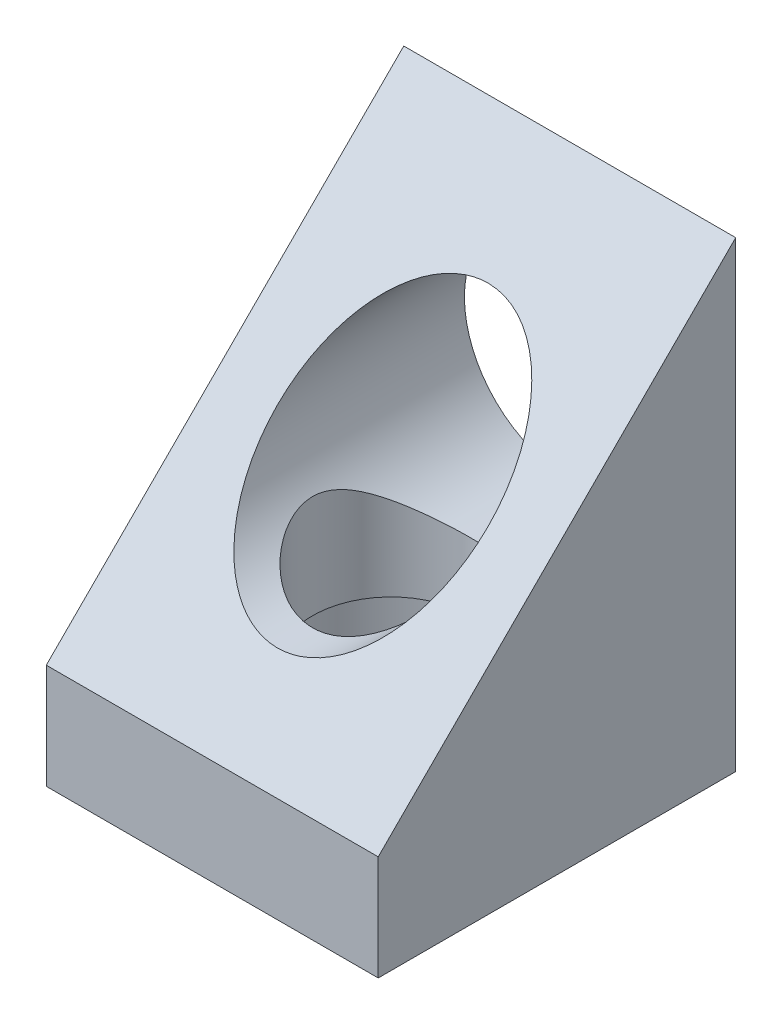
ISO-10303-21;
HEADER;
FILE_DESCRIPTION(('STEP AP214'),'2;1');
FILE_NAME('part.step','',(''),(''),'','','');
FILE_SCHEMA(('AUTOMOTIVE_DESIGN { 1 0 10303 214 1 1 1 1 }'));
ENDSEC;
DATA;
#1=APPLICATION_CONTEXT('core data for automotive mechanical design processes');
#2=APPLICATION_PROTOCOL_DEFINITION('international standard','automotive_design',2000,#1);
#3=PRODUCT_CONTEXT('',#1,'mechanical');
#4=PRODUCT('Part','Part','',(#3));
#5=PRODUCT_RELATED_PRODUCT_CATEGORY('part','',(#4));
#6=PRODUCT_DEFINITION_FORMATION('','',#4);
#7=PRODUCT_DEFINITION_CONTEXT('part definition',#1,'design');
#8=PRODUCT_DEFINITION('design','',#6,#7);
#9=PRODUCT_DEFINITION_SHAPE('','',#8);
#10=(LENGTH_UNIT() NAMED_UNIT(*) SI_UNIT(.MILLI.,.METRE.));
#11=(NAMED_UNIT(*) PLANE_ANGLE_UNIT() SI_UNIT($,.RADIAN.));
#12=(NAMED_UNIT(*) SI_UNIT($,.STERADIAN.) SOLID_ANGLE_UNIT());
#13=UNCERTAINTY_MEASURE_WITH_UNIT(LENGTH_MEASURE(1.E-05),#10,'distance_accuracy_value','');
#14=(GEOMETRIC_REPRESENTATION_CONTEXT(3) GLOBAL_UNCERTAINTY_ASSIGNED_CONTEXT((#13)) GLOBAL_UNIT_ASSIGNED_CONTEXT((#10,
#11,#12)) REPRESENTATION_CONTEXT('',''));
#15=CARTESIAN_POINT('',(0.,0.,0.));
#16=DIRECTION('',(0.,0.,1.));
#17=DIRECTION('',(1.,0.,0.));
#18=AXIS2_PLACEMENT_3D('',#15,#16,#17);
#19=CARTESIAN_POINT('',(13.,36.2199999999999,-14.));
#20=DIRECTION('',(0.,-1.,0.));
#21=DIRECTION('',(0.,0.,-1.));
#22=AXIS2_PLACEMENT_3D('',#19,#20,#21);
#23=CYLINDRICAL_SURFACE('',#22,6.15);
#24=CARTESIAN_POINT('',(13.,13.33,-20.15));
#25=CARTESIAN_POINT('',(13.1503835526445,13.3300014199679,-20.1499985251012));
#26=CARTESIAN_POINT('',(13.3008161414363,13.3341222645287,-20.144473554206));
#27=CARTESIAN_POINT('',(13.6004980932007,13.3505133182725,-20.1224589342896));
#28=CARTESIAN_POINT('',(13.7497466155259,13.3627888699825,-20.1059620970814));
#29=CARTESIAN_POINT('',(14.0461132267396,13.3952329697566,-20.0622295326929));
#30=CARTESIAN_POINT('',(14.1932262120438,13.4154179578461,-20.0349714369881));
#31=CARTESIAN_POINT('',(14.4839817652055,13.4632259113498,-19.970134037649));
#32=CARTESIAN_POINT('',(14.6276227446917,13.4908522133675,-19.9325501038708));
#33=CARTESIAN_POINT('',(14.9095201747263,13.5527393482053,-19.847883715537));
#34=CARTESIAN_POINT('',(15.0478059963155,13.586955008632,-19.8008658469617));
#35=CARTESIAN_POINT('',(15.319289232892,13.6614618116622,-19.6977636052433));
#36=CARTESIAN_POINT('',(15.452484609643,13.7017553565852,-19.641675646459));
#37=CARTESIAN_POINT('',(15.843287727748,13.8305960889122,-19.460812310771));
#38=CARTESIAN_POINT('',(16.0924968201286,13.9271908334478,-19.3233198553164));
#39=CARTESIAN_POINT('',(16.5868880595482,14.1451845680513,-19.0051130282842));
#40=CARTESIAN_POINT('',(16.82957467279,14.2680501775405,-18.8215803401999));
#41=CARTESIAN_POINT('',(17.2829158004911,14.5240168404874,-18.4238238469546));
#42=CARTESIAN_POINT('',(17.4935189977293,14.6571337894449,-18.2095519155904));
#43=CARTESIAN_POINT('',(17.8035772714523,14.8711845699739,-17.8445333561419));
#44=CARTESIAN_POINT('',(17.9138410115293,14.9517364840365,-17.7025735728797));
#45=CARTESIAN_POINT('',(18.1219724628634,15.111223854249,-17.4088572193787));
#46=CARTESIAN_POINT('',(18.2198364755572,15.1901588222417,-17.2570977463918));
#47=CARTESIAN_POINT('',(18.4025304161034,15.3438631312988,-16.9441377501915));
#48=CARTESIAN_POINT('',(18.4873738814289,15.4186367466421,-16.7829472766463));
#49=CARTESIAN_POINT('',(18.6433565718706,15.5611810056015,-16.4512517588928));
#50=CARTESIAN_POINT('',(18.7145035719045,15.628955612076,-16.2807520701247));
#51=CARTESIAN_POINT('',(18.8624032070704,15.7740871132528,-15.8748048903036));
#52=CARTESIAN_POINT('',(18.9337747240707,15.84766371032,-15.6359117024777));
#53=CARTESIAN_POINT('',(19.0191884046415,15.9378741132208,-15.2679653546693));
#54=CARTESIAN_POINT('',(19.0440445846388,15.9645759516353,-15.1437868612718));
#55=CARTESIAN_POINT('',(19.0861822905643,16.0102733578994,-14.8927778887567));
#56=CARTESIAN_POINT('',(19.1034676915191,16.0292728677365,-14.7659488012305));
#57=CARTESIAN_POINT('',(19.1302452216894,16.0588587949102,-14.5093040064635));
#58=CARTESIAN_POINT('',(19.1396649864281,16.0693670643076,-14.3794716225041));
#59=CARTESIAN_POINT('',(19.1502283089094,16.0811587061334,-14.1190489782193));
#60=CARTESIAN_POINT('',(19.1513720666929,16.082442301533,-13.9884587362887));
#61=CARTESIAN_POINT('',(19.1453515649405,16.0757129473225,-13.7276611377051));
#62=CARTESIAN_POINT('',(19.1381842327849,16.0676965594973,-13.5974539405108));
#63=CARTESIAN_POINT('',(19.1157168989009,16.0427827689124,-13.3386348528672));
#64=CARTESIAN_POINT('',(19.1004168019612,16.0258852621803,-13.2100229811126));
#65=CARTESIAN_POINT('',(19.0467443354251,15.9673319698838,-12.8543078776177));
#66=CARTESIAN_POINT('',(18.9996965676281,15.916667929872,-12.6299307702371));
#67=CARTESIAN_POINT('',(18.8828746150533,15.7954282493518,-12.1928845564181));
#68=CARTESIAN_POINT('',(18.8130791158108,15.7248339426545,-11.9802266501189));
#69=CARTESIAN_POINT('',(18.6683154596379,15.5849331328068,-11.6073639586438));
#70=CARTESIAN_POINT('',(18.596865978583,15.5179435013044,-11.444884611894));
#71=CARTESIAN_POINT('',(18.4414054344089,15.3780211018212,-11.1286465337572));
#72=CARTESIAN_POINT('',(18.3573880519886,15.3050853524991,-10.9748922433947));
#73=CARTESIAN_POINT('',(18.1772566451757,15.1556524175246,-10.6759927602815));
#74=CARTESIAN_POINT('',(18.0811181017668,15.0791482169044,-10.5308659205072));
#75=CARTESIAN_POINT('',(17.8773018815927,14.9248694389583,-10.2497247243449));
#76=CARTESIAN_POINT('',(17.769625983052,14.8470950589636,-10.1137089689243));
#77=CARTESIAN_POINT('',(17.5403090348244,14.6903089830559,-9.84793754530147));
#78=CARTESIAN_POINT('',(17.4183976075493,14.6113116157989,-9.7184064735335));
#79=CARTESIAN_POINT('',(17.1629728921322,14.4557795166642,-9.46966522747358));
#80=CARTESIAN_POINT('',(17.0294584348509,14.3792450340177,-9.35045609565793));
#81=CARTESIAN_POINT('',(16.7513392766245,14.2305251726609,-9.12330713036188));
#82=CARTESIAN_POINT('',(16.6067539540189,14.1583325724192,-9.01534835274987));
#83=CARTESIAN_POINT('',(16.3066955897243,14.0198712931162,-8.81144097332652));
#84=CARTESIAN_POINT('',(16.1512254156453,13.9536010642036,-8.71548922669628));
#85=CARTESIAN_POINT('',(15.8627745850373,13.8414051574285,-8.55496247225651));
#86=CARTESIAN_POINT('',(15.7316715681266,13.7940863503428,-8.48797887560631));
#87=CARTESIAN_POINT('',(15.4634196042388,13.7051018024051,-8.36298404873124));
#88=CARTESIAN_POINT('',(15.3262719098137,13.6634348976193,-8.30497097080254));
#89=CARTESIAN_POINT('',(15.0465475262124,13.5865540971867,-8.19857522019021));
#90=CARTESIAN_POINT('',(14.9039715858824,13.5513393153139,-8.15019122483334));
#91=CARTESIAN_POINT('',(14.6142426333555,13.4881095552341,-8.06370811731971));
#92=CARTESIAN_POINT('',(14.4670919023396,13.4600910512237,-8.02560396810812));
#93=CARTESIAN_POINT('',(14.1681992195679,13.4117156311941,-7.96001957791852));
#94=CARTESIAN_POINT('',(14.0164342369735,13.3914079389307,-7.9326075633627));
#95=CARTESIAN_POINT('',(13.7103883775554,13.3592019548532,-7.88921179838236));
#96=CARTESIAN_POINT('',(13.5561074954553,13.3473036806775,-7.87322807192802));
#97=CARTESIAN_POINT('',(13.2463980660886,13.3322234851936,-7.85297932629021));
#98=CARTESIAN_POINT('',(13.0909698755402,13.3290389603503,-7.84871080678082));
#99=CARTESIAN_POINT('',(12.7803130546598,13.3314631104223,-7.85196271098836));
#100=CARTESIAN_POINT('',(12.6250844104495,13.3370711365554,-7.85948226489043));
#101=CARTESIAN_POINT('',(12.3312525445608,13.3559621596412,-7.8848662369877));
#102=CARTESIAN_POINT('',(12.1925023941041,13.368444560283,-7.90165192834416));
#103=CARTESIAN_POINT('',(11.917180078369,13.4001949211975,-7.94447216115094));
#104=CARTESIAN_POINT('',(11.7806086549909,13.4194651433947,-7.97050978567375));
#105=CARTESIAN_POINT('',(11.5105765843834,13.4644074732554,-8.03147693721437));
#106=CARTESIAN_POINT('',(11.3771152161514,13.490078080646,-8.06640438046706));
#107=CARTESIAN_POINT('',(11.1139805602036,13.5473417543742,-8.14471988133054));
#108=CARTESIAN_POINT('',(10.9843087591956,13.5789371099696,-8.18811120955497));
#109=CARTESIAN_POINT('',(10.5920697568549,13.6844724694586,-8.33395843359274));
#110=CARTESIAN_POINT('',(10.3366992480016,13.7673842215363,-8.44971598515288));
#111=CARTESIAN_POINT('',(9.84910994669114,13.9509453589326,-8.71122569130956));
#112=CARTESIAN_POINT('',(9.61689429239517,14.0515971434431,-8.85698190342339));
#113=CARTESIAN_POINT('',(9.14040788222493,14.282918349312,-9.20141834279315));
#114=CARTESIAN_POINT('',(8.90066738642173,14.4157898533773,-9.40487606875184));
#115=CARTESIAN_POINT('',(8.45624701433959,14.6890661957817,-9.8437199101059));
#116=CARTESIAN_POINT('',(8.2516502953788,14.8294878968873,-10.0791794549961));
#117=CARTESIAN_POINT('',(7.95537091235652,15.050587695223,-10.477454441605));
#118=CARTESIAN_POINT('',(7.85161488532976,15.1323294603111,-10.6308514530491));
#119=CARTESIAN_POINT('',(7.65755892732338,15.2921860215197,-10.9478896427712));
#120=CARTESIAN_POINT('',(7.56726395601245,15.3702994735422,-11.111534565468));
#121=CARTESIAN_POINT('',(7.40115362223093,15.5196479867042,-11.448411255696));
#122=CARTESIAN_POINT('',(7.32530071928809,15.5909006363437,-11.6216166154887));
#123=CARTESIAN_POINT('',(7.18889778872965,15.723156426159,-11.9776602403522));
#124=CARTESIAN_POINT('',(7.12833461915968,15.7841683532991,-12.1604900684216));
#125=CARTESIAN_POINT('',(7.04427508150341,15.8708897526173,-12.4618519682143));
#126=CARTESIAN_POINT('',(7.01553429544381,15.9010872964806,-12.5776519288662));
#127=CARTESIAN_POINT('',(6.96462170907074,15.9552252375627,-12.8121085549246));
#128=CARTESIAN_POINT('',(6.94244760089174,15.9791678327401,-12.9307642008072));
#129=CARTESIAN_POINT('',(6.90504066856674,16.0198976800538,-13.170167951057));
#130=CARTESIAN_POINT('',(6.88979559134392,16.0366975597153,-13.2909119666798));
#131=CARTESIAN_POINT('',(6.86647127095029,16.0625159013193,-13.5339289578434));
#132=CARTESIAN_POINT('',(6.85839207854978,16.0715343081302,-13.6562019442107));
#133=CARTESIAN_POINT('',(6.84954956435078,16.0814088027616,-13.9018686433638));
#134=CARTESIAN_POINT('',(6.8488175400062,16.0822299719229,-14.0252649113244));
#135=CARTESIAN_POINT('',(6.8547666225232,16.0755812654832,-14.2716484632016));
#136=CARTESIAN_POINT('',(6.86144760622128,16.0681115276315,-14.394635753879));
#137=CARTESIAN_POINT('',(6.88209106960075,16.0452077127902,-14.6393641625517));
#138=CARTESIAN_POINT('',(6.89606079405127,16.0297657117933,-14.7611039175534));
#139=CARTESIAN_POINT('',(6.93102348333077,15.9915574000269,-15.002450113829));
#140=CARTESIAN_POINT('',(6.95202015568746,15.9687872230408,-15.122055393757));
#141=CARTESIAN_POINT('',(7.00657808354109,15.9104895039723,-15.3870265425406));
#142=CARTESIAN_POINT('',(7.04194935897705,15.8732088874352,-15.5316346872131));
#143=CARTESIAN_POINT('',(7.12231783423728,15.7904687039375,-15.8158164272395));
#144=CARTESIAN_POINT('',(7.16732240978662,15.7450028742414,-15.9553860686364));
#145=CARTESIAN_POINT('',(7.26640134096596,15.6476162051598,-16.2292589359119));
#146=CARTESIAN_POINT('',(7.32049344462617,15.5956827868813,-16.3635512091706));
#147=CARTESIAN_POINT('',(7.43713309340349,15.4871056580072,-16.6263424712906));
#148=CARTESIAN_POINT('',(7.49967794623103,15.4304634494127,-16.7548432874843));
#149=CARTESIAN_POINT('',(7.65453136770457,15.2949216864014,-17.0469643751123));
#150=CARTESIAN_POINT('',(7.7498995378241,15.2147810837787,-17.2083931632928));
#151=CARTESIAN_POINT('',(7.95417664713756,15.0516564599592,-17.5209420788869));
#152=CARTESIAN_POINT('',(8.06308950461766,14.968671621018,-17.672059203611));
#153=CARTESIAN_POINT('',(8.29410866658503,14.8022890967329,-17.9638017758568));
#154=CARTESIAN_POINT('',(8.41622359359865,14.7188911759355,-18.1044202639344));
#155=CARTESIAN_POINT('',(8.67328408887425,14.5539519278295,-18.3745611997179));
#156=CARTESIAN_POINT('',(8.80822816834386,14.4724103864503,-18.5040849316354));
#157=CARTESIAN_POINT('',(9.09155879207927,14.3127313634136,-18.7520778794231));
#158=CARTESIAN_POINT('',(9.24002300567526,14.2346179390241,-18.8704741014983));
#159=CARTESIAN_POINT('',(9.54932004994794,14.0843434709555,-19.0942851243129));
#160=CARTESIAN_POINT('',(9.71015446224907,14.0121831908842,-19.1996982605684));
#161=CARTESIAN_POINT('',(10.0432299725173,13.875953984831,-19.3960458913506));
#162=CARTESIAN_POINT('',(10.2154487864506,13.8118699257947,-19.4870075507384));
#163=CARTESIAN_POINT('',(10.5705231959585,13.6936127746643,-19.6531859789711));
#164=CARTESIAN_POINT('',(10.7533731062955,13.6394344483346,-19.7284110661415));
#165=CARTESIAN_POINT('',(11.0729658889595,13.557051483312,-19.8419808962255));
#166=CARTESIAN_POINT('',(11.2074260488283,13.5258967457112,-19.8846622942644));
#167=CARTESIAN_POINT('',(11.4801928230307,13.4700031781813,-19.9609331432457));
#168=CARTESIAN_POINT('',(11.6184984912929,13.4452627853924,-19.9945248089954));
#169=CARTESIAN_POINT('',(11.8977859311765,13.4027429439314,-20.0520994923567));
#170=CARTESIAN_POINT('',(12.038760319978,13.3849465972274,-20.076105838784));
#171=CARTESIAN_POINT('',(12.3227056691438,13.3566123587213,-20.1142676712942));
#172=CARTESIAN_POINT('',(12.465675465979,13.3460704036014,-20.1284286719816));
#173=CARTESIAN_POINT('',(12.6741175501309,13.336181382435,-20.1417058802917));
#174=CARTESIAN_POINT('',(12.7392262211555,13.3338648618369,-20.1448146206501));
#175=CARTESIAN_POINT('',(12.8695535114056,13.3307737689009,-20.1489621262456));
#176=CARTESIAN_POINT('',(12.9347721430381,13.3299993840984,-20.1500006397275));
#177=CARTESIAN_POINT('',(13.,13.33,-20.15));
#178=B_SPLINE_CURVE_WITH_KNOTS('',3,(#24,#25,#26,#27,#28,#29,#30,#31,#32,#33,#34,#35,#36,#37,
#38,#39,#40,#41,#42,#43,#44,#45,#46,#47,#48,#49,#50,#51,#52,#53,#54,#55,#56,#57,#58,#59,#60,#61,
#62,#63,#64,#65,#66,#67,#68,#69,#70,#71,#72,#73,#74,#75,#76,#77,#78,#79,#80,#81,#82,#83,#84,#85,
#86,#87,#88,#89,#90,#91,#92,#93,#94,#95,#96,#97,#98,#99,#100,#101,#102,#103,#104,#105,#106,#107,
#108,#109,#110,#111,#112,#113,#114,#115,#116,#117,#118,#119,#120,#121,#122,#123,#124,#125,#126,
#127,#128,#129,#130,#131,#132,#133,#134,#135,#136,#137,#138,#139,#140,#141,#142,#143,#144,#145,
#146,#147,#148,#149,#150,#151,#152,#153,#154,#155,#156,#157,#158,#159,#160,#161,#162,#163,#164,
#165,#166,#167,#168,#169,#170,#171,#172,#173,#174,#175,#176,#177),.UNSPECIFIED.,.T.,.F.,(4,2,2,
2,2,2,2,2,2,2,2,2,2,2,2,2,2,2,2,2,2,2,2,2,2,2,2,2,2,2,2,2,2,2,2,2,2,2,2,2,2,2,2,2,2,2,2,2,2,2,2,
2,2,2,2,2,2,2,2,2,2,2,2,2,2,2,2,2,2,2,2,2,2,2,2,2,4),(0.,0.451079237182991,0.902454289130928,
1.35477255859521,1.80729398120172,2.25681705565752,2.70651827460123,3.60470017589006,
4.58579794928882,5.56844886815121,6.15882888632726,6.74938458925403,7.33932206939578,
7.92892367247674,8.705557499723,9.09344527057253,9.48113427231927,9.87235192774408,
10.2635601269433,10.6549130023966,11.0462704595694,11.7477974115607,12.4499835882915,
13.0183947111402,13.5870926050577,14.1569599099271,14.7267395085248,15.3100154248343,
15.8933501812273,16.4756862423,17.0578694602872,17.5213519651965,17.984738876701,
18.4480620922984,18.9111578686219,19.3771621163229,19.8431673414391,20.3090333161056,
20.7748649172102,21.1953323757727,21.6159400806208,22.0364492860693,22.4571213077065,
23.3306126316872,24.2042221788825,25.2246174960049,26.2473949751393,26.8540658428236,
27.4609596862828,28.0662537732772,28.6710258080114,29.0399381455199,29.4087206741266,
29.7768484976726,30.1449789293841,30.514676860302,30.8843686489611,31.2544286011388,
31.6246841113671,32.0843939920525,32.5444571161802,33.0054294217195,33.4662552472475,
34.0771574390528,34.6882367691004,35.2997176458723,35.9111276481731,36.5263031202494,
37.1415573783844,37.7556410808281,38.3693993548291,38.8023797449164,39.2352545396639,
39.6670692833567,40.0986419623984,40.2942707665128,40.4899233591271),.UNSPECIFIED.);
#179=CARTESIAN_POINT('',(13.,13.33,-20.15));
#180=VERTEX_POINT('',#179);
#181=EDGE_CURVE('E126',#180,#180,#178,.T.);
#182=ORIENTED_EDGE('',*,*,#181,.F.);
#183=EDGE_LOOP('',(#182));
#184=FACE_BOUND('',#183,.T.);
#185=CARTESIAN_POINT('',(13.,8.,-14.));
#186=DIRECTION('',(0.,-1.,0.));
#187=DIRECTION('',(0.,0.,-1.));
#188=AXIS2_PLACEMENT_3D('',#185,#186,#187);
#189=CIRCLE('',#188,6.15);
#190=CARTESIAN_POINT('',(13.,8.,-20.15));
#191=VERTEX_POINT('',#190);
#192=EDGE_CURVE('E52',#191,#191,#189,.F.);
#193=ORIENTED_EDGE('',*,*,#192,.F.);
#194=EDGE_LOOP('',(#193));
#195=FACE_BOUND('',#194,.T.);
#196=ADVANCED_FACE('F48',(#184,#195),#23,.F.);
#197=CARTESIAN_POINT('',(26.,8.22,0.));
#198=DIRECTION('',(0.,0.,-1.));
#199=DIRECTION('',(0.,1.,0.));
#200=AXIS2_PLACEMENT_3D('',#197,#198,#199);
#201=PLANE('',#200);
#202=DIRECTION('',(0.,-1.,0.));
#203=VECTOR('',#202,1.);
#204=CARTESIAN_POINT('',(0.,8.22,0.));
#205=LINE('',#204,#203);
#206=CARTESIAN_POINT('',(0.,8.22,0.));
#207=VERTEX_POINT('',#206);
#208=CARTESIAN_POINT('',(0.,0.,0.));
#209=VERTEX_POINT('',#208);
#210=EDGE_CURVE('E115',#207,#209,#205,.T.);
#211=ORIENTED_EDGE('',*,*,#210,.T.);
#212=DIRECTION('',(-1.,0.,0.));
#213=VECTOR('',#212,1.);
#214=CARTESIAN_POINT('',(26.,0.,0.));
#215=LINE('',#214,#213);
#216=CARTESIAN_POINT('',(26.,0.,0.));
#217=VERTEX_POINT('',#216);
#218=EDGE_CURVE('E13',#217,#209,#215,.T.);
#219=ORIENTED_EDGE('',*,*,#218,.F.);
#220=DIRECTION('',(0.,-1.,0.));
#221=VECTOR('',#220,1.);
#222=CARTESIAN_POINT('',(26.,8.22,0.));
#223=LINE('',#222,#221);
#224=CARTESIAN_POINT('',(26.,8.22,0.));
#225=VERTEX_POINT('',#224);
#226=EDGE_CURVE('E102',#225,#217,#223,.T.);
#227=ORIENTED_EDGE('',*,*,#226,.F.);
#228=DIRECTION('',(-1.,0.,0.));
#229=VECTOR('',#228,1.);
#230=CARTESIAN_POINT('',(26.,8.22,0.));
#231=LINE('',#230,#229);
#232=EDGE_CURVE('E111',#225,#207,#231,.T.);
#233=ORIENTED_EDGE('',*,*,#232,.T.);
#234=EDGE_LOOP('',(#211,#219,#227,#233));
#235=FACE_BOUND('',#234,.T.);
#236=ADVANCED_FACE('F50',(#235),#201,.F.);
#237=CARTESIAN_POINT('',(26.,0.,0.));
#238=DIRECTION('',(0.,1.,0.));
#239=DIRECTION('',(0.,0.,1.));
#240=AXIS2_PLACEMENT_3D('',#237,#238,#239);
#241=PLANE('',#240);
#242=CARTESIAN_POINT('',(3.7,0.,-22.65));
#243=DIRECTION('',(0.,-1.,0.));
#244=DIRECTION('',(0.,0.,-1.));
#245=AXIS2_PLACEMENT_3D('',#242,#243,#244);
#246=CIRCLE('',#245,1.25);
#247=CARTESIAN_POINT('',(3.7,0.,-23.9));
#248=VERTEX_POINT('',#247);
#249=EDGE_CURVE('E208',#248,#248,#246,.T.);
#250=ORIENTED_EDGE('',*,*,#249,.F.);
#251=EDGE_LOOP('',(#250));
#252=FACE_BOUND('',#251,.T.);
#253=CARTESIAN_POINT('',(22.85,0.,-22.95));
#254=DIRECTION('',(0.,-1.,0.));
#255=DIRECTION('',(0.,0.,-1.));
#256=AXIS2_PLACEMENT_3D('',#253,#254,#255);
#257=CIRCLE('',#256,1.25);
#258=CARTESIAN_POINT('',(22.85,0.,-24.2));
#259=VERTEX_POINT('',#258);
#260=EDGE_CURVE('E202',#259,#259,#257,.T.);
#261=ORIENTED_EDGE('',*,*,#260,.F.);
#262=EDGE_LOOP('',(#261));
#263=FACE_BOUND('',#262,.T.);
#264=CARTESIAN_POINT('',(23.05,0.,-3.75));
#265=DIRECTION('',(0.,-1.,0.));
#266=DIRECTION('',(0.,0.,-1.));
#267=AXIS2_PLACEMENT_3D('',#264,#265,#266);
#268=CIRCLE('',#267,1.25);
#269=CARTESIAN_POINT('',(23.05,0.,-5.));
#270=VERTEX_POINT('',#269);
#271=EDGE_CURVE('E196',#270,#270,#268,.T.);
#272=ORIENTED_EDGE('',*,*,#271,.F.);
#273=EDGE_LOOP('',(#272));
#274=FACE_BOUND('',#273,.T.);
#275=CARTESIAN_POINT('',(3.9,0.,-3.85));
#276=DIRECTION('',(0.,-1.,0.));
#277=DIRECTION('',(0.,0.,-1.));
#278=AXIS2_PLACEMENT_3D('',#275,#276,#277);
#279=CIRCLE('',#278,1.25);
#280=CARTESIAN_POINT('',(3.9,0.,-5.1));
#281=VERTEX_POINT('',#280);
#282=EDGE_CURVE('E185',#281,#281,#279,.T.);
#283=ORIENTED_EDGE('',*,*,#282,.F.);
#284=EDGE_LOOP('',(#283));
#285=FACE_BOUND('',#284,.T.);
#286=CARTESIAN_POINT('',(13.,0.,-14.));
#287=DIRECTION('',(0.,-1.,0.));
#288=DIRECTION('',(0.,0.,-1.));
#289=AXIS2_PLACEMENT_3D('',#286,#287,#288);
#290=CIRCLE('',#289,10.325);
#291=CARTESIAN_POINT('',(13.,0.,-24.325));
#292=VERTEX_POINT('',#291);
#293=EDGE_CURVE('E184',#292,#292,#290,.T.);
#294=ORIENTED_EDGE('',*,*,#293,.F.);
#295=EDGE_LOOP('',(#294));
#296=FACE_BOUND('',#295,.T.);
#297=DIRECTION('',(0.,0.,-1.));
#298=VECTOR('',#297,1.);
#299=CARTESIAN_POINT('',(0.,0.,0.));
#300=LINE('',#299,#298);
#301=CARTESIAN_POINT('',(0.,0.,-28.));
#302=VERTEX_POINT('',#301);
#303=EDGE_CURVE('E106',#209,#302,#300,.T.);
#304=ORIENTED_EDGE('',*,*,#303,.T.);
#305=DIRECTION('',(-1.,0.,0.));
#306=VECTOR('',#305,1.);
#307=CARTESIAN_POINT('',(26.,0.,-28.));
#308=LINE('',#307,#306);
#309=CARTESIAN_POINT('',(26.,0.,-28.));
#310=VERTEX_POINT('',#309);
#311=EDGE_CURVE('E58',#310,#302,#308,.T.);
#312=ORIENTED_EDGE('',*,*,#311,.F.);
#313=DIRECTION('',(0.,0.,-1.));
#314=VECTOR('',#313,1.);
#315=CARTESIAN_POINT('',(26.,0.,0.));
#316=LINE('',#315,#314);
#317=EDGE_CURVE('E97',#217,#310,#316,.T.);
#318=ORIENTED_EDGE('',*,*,#317,.F.);
#319=ORIENTED_EDGE('',*,*,#218,.T.);
#320=EDGE_LOOP('',(#304,#312,#318,#319));
#321=FACE_BOUND('',#320,.T.);
#322=ADVANCED_FACE('F105',(#252,#263,#274,#285,#296,#321),#241,.F.);
#323=CARTESIAN_POINT('',(26.,0.,-28.));
#324=DIRECTION('',(0.,0.,1.));
#325=DIRECTION('',(1.,0.,0.));
#326=AXIS2_PLACEMENT_3D('',#323,#324,#325);
#327=PLANE('',#326);
#328=CARTESIAN_POINT('',(13.,21.58,-28.));
#329=DIRECTION('',(0.,0.,-1.));
#330=DIRECTION('',(-1.,0.,0.));
#331=AXIS2_PLACEMENT_3D('',#328,#329,#330);
#332=CIRCLE('',#331,8.25);
#333=CARTESIAN_POINT('',(4.75,21.58,-28.));
#334=VERTEX_POINT('',#333);
#335=EDGE_CURVE('E125',#334,#334,#332,.T.);
#336=ORIENTED_EDGE('',*,*,#335,.F.);
#337=EDGE_LOOP('',(#336));
#338=FACE_BOUND('',#337,.T.);
#339=DIRECTION('',(0.,1.,0.));
#340=VECTOR('',#339,1.);
#341=CARTESIAN_POINT('',(0.,0.,-28.));
#342=LINE('',#341,#340);
#343=CARTESIAN_POINT('',(0.,36.2199999999999,-28.));
#344=VERTEX_POINT('',#343);
#345=EDGE_CURVE('E84',#302,#344,#342,.T.);
#346=ORIENTED_EDGE('',*,*,#345,.T.);
#347=DIRECTION('',(-1.,0.,0.));
#348=VECTOR('',#347,1.);
#349=CARTESIAN_POINT('',(26.,36.2199999999999,-28.));
#350=LINE('',#349,#348);
#351=CARTESIAN_POINT('',(26.,36.2199999999999,-28.));
#352=VERTEX_POINT('',#351);
#353=EDGE_CURVE('E107',#352,#344,#350,.T.);
#354=ORIENTED_EDGE('',*,*,#353,.F.);
#355=DIRECTION('',(0.,1.,0.));
#356=VECTOR('',#355,1.);
#357=CARTESIAN_POINT('',(26.,0.,-28.));
#358=LINE('',#357,#356);
#359=EDGE_CURVE('E100',#310,#352,#358,.T.);
#360=ORIENTED_EDGE('',*,*,#359,.F.);
#361=ORIENTED_EDGE('',*,*,#311,.T.);
#362=EDGE_LOOP('',(#346,#354,#360,#361));
#363=FACE_BOUND('',#362,.T.);
#364=ADVANCED_FACE('F109',(#338,#363),#327,.F.);
#365=CARTESIAN_POINT('',(26.,36.2199999999999,-28.));
#366=DIRECTION('',(0.,-0.707106781186549,-0.707106781186546));
#367=DIRECTION('',(0.,0.707106781186546,-0.707106781186549));
#368=AXIS2_PLACEMENT_3D('',#365,#366,#367);
#369=PLANE('',#368);
#370=CARTESIAN_POINT('',(13.,21.58,-13.36));
#371=DIRECTION('',(0.,-0.707106781186549,-0.707106781186546));
#372=DIRECTION('',(0.,0.707106781186546,-0.707106781186549));
#373=AXIS2_PLACEMENT_3D('',#370,#371,#372);
#374=ELLIPSE('',#373,11.6672618895781,8.25);
#375=CARTESIAN_POINT('',(13.,29.83,-21.6100000000001));
#376=VERTEX_POINT('',#375);
#377=EDGE_CURVE('E118',#376,#376,#374,.T.);
#378=ORIENTED_EDGE('',*,*,#377,.T.);
#379=EDGE_LOOP('',(#378));
#380=FACE_BOUND('',#379,.T.);
#381=DIRECTION('',(0.,-0.707106781186546,0.707106781186549));
#382=VECTOR('',#381,1.);
#383=CARTESIAN_POINT('',(0.,36.2199999999999,-28.));
#384=LINE('',#383,#382);
#385=EDGE_CURVE('E90',#344,#207,#384,.T.);
#386=ORIENTED_EDGE('',*,*,#385,.T.);
#387=ORIENTED_EDGE('',*,*,#232,.F.);
#388=DIRECTION('',(0.,-0.707106781186546,0.707106781186549));
#389=VECTOR('',#388,1.);
#390=CARTESIAN_POINT('',(26.,36.2199999999999,-28.));
#391=LINE('',#390,#389);
#392=EDGE_CURVE('E67',#352,#225,#391,.T.);
#393=ORIENTED_EDGE('',*,*,#392,.F.);
#394=ORIENTED_EDGE('',*,*,#353,.T.);
#395=EDGE_LOOP('',(#386,#387,#393,#394));
#396=FACE_BOUND('',#395,.T.);
#397=ADVANCED_FACE('F219',(#380,#396),#369,.F.);
#398=CARTESIAN_POINT('',(26.,0.,0.));
#399=DIRECTION('',(1.,0.,0.));
#400=DIRECTION('',(0.,0.,-1.));
#401=AXIS2_PLACEMENT_3D('',#398,#399,#400);
#402=PLANE('',#401);
#403=ORIENTED_EDGE('',*,*,#226,.T.);
#404=ORIENTED_EDGE('',*,*,#317,.T.);
#405=ORIENTED_EDGE('',*,*,#359,.T.);
#406=ORIENTED_EDGE('',*,*,#392,.T.);
#407=EDGE_LOOP('',(#403,#404,#405,#406));
#408=FACE_BOUND('',#407,.T.);
#409=ADVANCED_FACE('F98',(#408),#402,.T.);
#410=CARTESIAN_POINT('',(0.,0.,0.));
#411=DIRECTION('',(1.,0.,0.));
#412=DIRECTION('',(0.,0.,-1.));
#413=AXIS2_PLACEMENT_3D('',#410,#411,#412);
#414=PLANE('',#413);
#415=ORIENTED_EDGE('',*,*,#210,.F.);
#416=ORIENTED_EDGE('',*,*,#385,.F.);
#417=ORIENTED_EDGE('',*,*,#345,.F.);
#418=ORIENTED_EDGE('',*,*,#303,.F.);
#419=EDGE_LOOP('',(#415,#416,#417,#418));
#420=FACE_BOUND('',#419,.T.);
#421=ADVANCED_FACE('F229',(#420),#414,.F.);
#422=CARTESIAN_POINT('',(13.,21.58,0.));
#423=DIRECTION('',(0.,0.,-1.));
#424=DIRECTION('',(-1.,0.,0.));
#425=AXIS2_PLACEMENT_3D('',#422,#423,#424);
#426=CYLINDRICAL_SURFACE('',#425,8.25);
#427=ORIENTED_EDGE('',*,*,#181,.T.);
#428=EDGE_LOOP('',(#427));
#429=FACE_BOUND('',#428,.T.);
#430=ORIENTED_EDGE('',*,*,#335,.T.);
#431=EDGE_LOOP('',(#430));
#432=FACE_BOUND('',#431,.T.);
#433=ORIENTED_EDGE('',*,*,#377,.F.);
#434=EDGE_LOOP('',(#433));
#435=FACE_BOUND('',#434,.T.);
#436=ADVANCED_FACE('F133',(#429,#432,#435),#426,.F.);
#437=CARTESIAN_POINT('',(13.,8.,-14.));
#438=DIRECTION('',(0.,-1.,0.));
#439=DIRECTION('',(0.,0.,-1.));
#440=AXIS2_PLACEMENT_3D('',#437,#438,#439);
#441=PLANE('',#440);
#442=CARTESIAN_POINT('',(13.,8.,-14.));
#443=DIRECTION('',(0.,-1.,0.));
#444=DIRECTION('',(0.,0.,-1.));
#445=AXIS2_PLACEMENT_3D('',#442,#443,#444);
#446=CIRCLE('',#445,10.325);
#447=CARTESIAN_POINT('',(13.,8.,-24.325));
#448=VERTEX_POINT('',#447);
#449=EDGE_CURVE('E188',#448,#448,#446,.T.);
#450=ORIENTED_EDGE('',*,*,#449,.T.);
#451=EDGE_LOOP('',(#450));
#452=FACE_BOUND('',#451,.T.);
#453=ORIENTED_EDGE('',*,*,#192,.T.);
#454=EDGE_LOOP('',(#453));
#455=FACE_BOUND('',#454,.T.);
#456=ADVANCED_FACE('F144',(#452,#455),#441,.T.);
#457=CARTESIAN_POINT('',(13.,8.,-14.));
#458=DIRECTION('',(0.,-1.,0.));
#459=DIRECTION('',(0.,0.,-1.));
#460=AXIS2_PLACEMENT_3D('',#457,#458,#459);
#461=CYLINDRICAL_SURFACE('',#460,10.325);
#462=ORIENTED_EDGE('',*,*,#449,.F.);
#463=EDGE_LOOP('',(#462));
#464=FACE_BOUND('',#463,.T.);
#465=ORIENTED_EDGE('',*,*,#293,.T.);
#466=EDGE_LOOP('',(#465));
#467=FACE_BOUND('',#466,.T.);
#468=ADVANCED_FACE('F140',(#464,#467),#461,.F.);
#469=CARTESIAN_POINT('',(3.9,8.,-3.85));
#470=DIRECTION('',(0.,-1.,0.));
#471=DIRECTION('',(0.,0.,-1.));
#472=AXIS2_PLACEMENT_3D('',#469,#470,#471);
#473=CYLINDRICAL_SURFACE('',#472,1.25);
#474=CARTESIAN_POINT('',(3.9,8.,-3.85));
#475=DIRECTION('',(0.,-1.,0.));
#476=DIRECTION('',(0.,0.,-1.));
#477=AXIS2_PLACEMENT_3D('',#474,#475,#476);
#478=CIRCLE('',#477,1.25);
#479=CARTESIAN_POINT('',(3.9,8.,-5.1));
#480=VERTEX_POINT('',#479);
#481=EDGE_CURVE('E183',#480,#480,#478,.T.);
#482=ORIENTED_EDGE('',*,*,#481,.F.);
#483=EDGE_LOOP('',(#482));
#484=FACE_BOUND('',#483,.T.);
#485=ORIENTED_EDGE('',*,*,#282,.T.);
#486=EDGE_LOOP('',(#485));
#487=FACE_BOUND('',#486,.T.);
#488=ADVANCED_FACE('F143',(#484,#487),#473,.F.);
#489=CARTESIAN_POINT('',(3.9,8.,-3.85));
#490=DIRECTION('',(0.,-1.,0.));
#491=DIRECTION('',(0.,0.,-1.));
#492=AXIS2_PLACEMENT_3D('',#489,#490,#491);
#493=PLANE('',#492);
#494=ORIENTED_EDGE('',*,*,#481,.T.);
#495=EDGE_LOOP('',(#494));
#496=FACE_BOUND('',#495,.T.);
#497=ADVANCED_FACE('F169',(#496),#493,.T.);
#498=CARTESIAN_POINT('',(23.05,8.,-3.75));
#499=DIRECTION('',(0.,-1.,0.));
#500=DIRECTION('',(0.,0.,-1.));
#501=AXIS2_PLACEMENT_3D('',#498,#499,#500);
#502=CYLINDRICAL_SURFACE('',#501,1.25);
#503=CARTESIAN_POINT('',(23.05,8.,-3.75));
#504=DIRECTION('',(0.,-1.,0.));
#505=DIRECTION('',(0.,0.,-1.));
#506=AXIS2_PLACEMENT_3D('',#503,#504,#505);
#507=CIRCLE('',#506,1.25);
#508=CARTESIAN_POINT('',(23.05,8.,-5.));
#509=VERTEX_POINT('',#508);
#510=EDGE_CURVE('E191',#509,#509,#507,.T.);
#511=ORIENTED_EDGE('',*,*,#510,.F.);
#512=EDGE_LOOP('',(#511));
#513=FACE_BOUND('',#512,.T.);
#514=ORIENTED_EDGE('',*,*,#271,.T.);
#515=EDGE_LOOP('',(#514));
#516=FACE_BOUND('',#515,.T.);
#517=ADVANCED_FACE('F166',(#513,#516),#502,.F.);
#518=CARTESIAN_POINT('',(23.05,8.,-3.75));
#519=DIRECTION('',(0.,-1.,0.));
#520=DIRECTION('',(0.,0.,-1.));
#521=AXIS2_PLACEMENT_3D('',#518,#519,#520);
#522=PLANE('',#521);
#523=ORIENTED_EDGE('',*,*,#510,.T.);
#524=EDGE_LOOP('',(#523));
#525=FACE_BOUND('',#524,.T.);
#526=ADVANCED_FACE('F161',(#525),#522,.T.);
#527=CARTESIAN_POINT('',(22.85,8.,-22.95));
#528=DIRECTION('',(0.,-1.,0.));
#529=DIRECTION('',(0.,0.,-1.));
#530=AXIS2_PLACEMENT_3D('',#527,#528,#529);
#531=CYLINDRICAL_SURFACE('',#530,1.25);
#532=CARTESIAN_POINT('',(22.85,8.,-22.95));
#533=DIRECTION('',(0.,-1.,0.));
#534=DIRECTION('',(0.,0.,-1.));
#535=AXIS2_PLACEMENT_3D('',#532,#533,#534);
#536=CIRCLE('',#535,1.25);
#537=CARTESIAN_POINT('',(22.85,8.,-24.2));
#538=VERTEX_POINT('',#537);
#539=EDGE_CURVE('E199',#538,#538,#536,.T.);
#540=ORIENTED_EDGE('',*,*,#539,.F.);
#541=EDGE_LOOP('',(#540));
#542=FACE_BOUND('',#541,.T.);
#543=ORIENTED_EDGE('',*,*,#260,.T.);
#544=EDGE_LOOP('',(#543));
#545=FACE_BOUND('',#544,.T.);
#546=ADVANCED_FACE('F158',(#542,#545),#531,.F.);
#547=CARTESIAN_POINT('',(22.85,8.,-22.95));
#548=DIRECTION('',(0.,-1.,0.));
#549=DIRECTION('',(0.,0.,-1.));
#550=AXIS2_PLACEMENT_3D('',#547,#548,#549);
#551=PLANE('',#550);
#552=ORIENTED_EDGE('',*,*,#539,.T.);
#553=EDGE_LOOP('',(#552));
#554=FACE_BOUND('',#553,.T.);
#555=ADVANCED_FACE('F153',(#554),#551,.T.);
#556=CARTESIAN_POINT('',(3.7,8.,-22.65));
#557=DIRECTION('',(0.,-1.,0.));
#558=DIRECTION('',(0.,0.,-1.));
#559=AXIS2_PLACEMENT_3D('',#556,#557,#558);
#560=CYLINDRICAL_SURFACE('',#559,1.25);
#561=CARTESIAN_POINT('',(3.7,8.,-22.65));
#562=DIRECTION('',(0.,-1.,0.));
#563=DIRECTION('',(0.,0.,-1.));
#564=AXIS2_PLACEMENT_3D('',#561,#562,#563);
#565=CIRCLE('',#564,1.25);
#566=CARTESIAN_POINT('',(3.7,8.,-23.9));
#567=VERTEX_POINT('',#566);
#568=EDGE_CURVE('E205',#567,#567,#565,.T.);
#569=ORIENTED_EDGE('',*,*,#568,.F.);
#570=EDGE_LOOP('',(#569));
#571=FACE_BOUND('',#570,.T.);
#572=ORIENTED_EDGE('',*,*,#249,.T.);
#573=EDGE_LOOP('',(#572));
#574=FACE_BOUND('',#573,.T.);
#575=ADVANCED_FACE('F149',(#571,#574),#560,.F.);
#576=CARTESIAN_POINT('',(3.7,8.,-22.65));
#577=DIRECTION('',(0.,-1.,0.));
#578=DIRECTION('',(0.,0.,-1.));
#579=AXIS2_PLACEMENT_3D('',#576,#577,#578);
#580=PLANE('',#579);
#581=ORIENTED_EDGE('',*,*,#568,.T.);
#582=EDGE_LOOP('',(#581));
#583=FACE_BOUND('',#582,.T.);
#584=ADVANCED_FACE('F152',(#583),#580,.T.);
#585=CLOSED_SHELL('',(#196,#236,#322,#364,#397,#409,#421,#436,#456,#468,#488,#497,#517,#526,
#546,#555,#575,#584));
#586=MANIFOLD_SOLID_BREP('B2',#585);
#587=ADVANCED_BREP_SHAPE_REPRESENTATION('',(#18,#586),#14);
#588=SHAPE_DEFINITION_REPRESENTATION(#9,#587);
ENDSEC;
END-ISO-10303-21;
